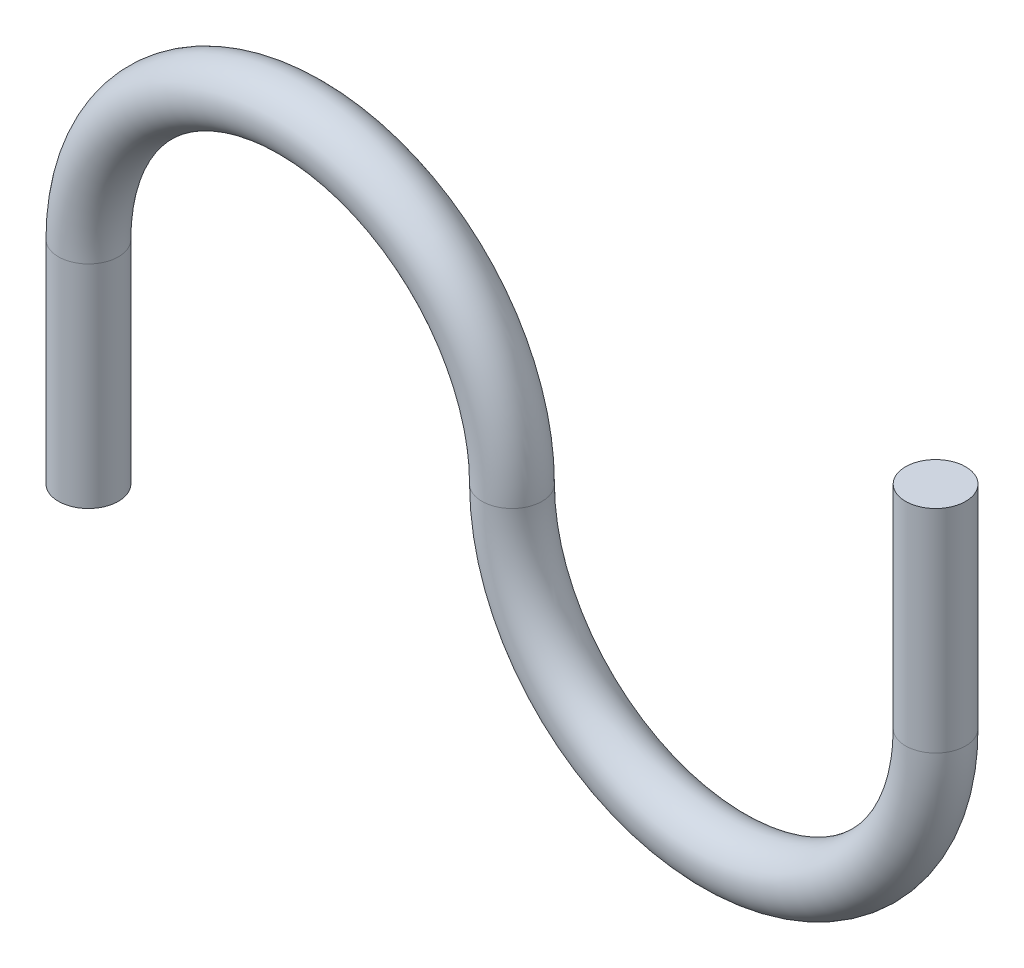
ISO-10303-21;
HEADER;
FILE_DESCRIPTION(('STEP AP214'),'2;1');
FILE_NAME('part.step','',(''),(''),'','','');
FILE_SCHEMA(('AUTOMOTIVE_DESIGN { 1 0 10303 214 1 1 1 1 }'));
ENDSEC;
DATA;
#1=APPLICATION_CONTEXT('core data for automotive mechanical design processes');
#2=APPLICATION_PROTOCOL_DEFINITION('international standard','automotive_design',2000,#1);
#3=PRODUCT_CONTEXT('',#1,'mechanical');
#4=PRODUCT('Part','Part','',(#3));
#5=PRODUCT_RELATED_PRODUCT_CATEGORY('part','',(#4));
#6=PRODUCT_DEFINITION_FORMATION('','',#4);
#7=PRODUCT_DEFINITION_CONTEXT('part definition',#1,'design');
#8=PRODUCT_DEFINITION('design','',#6,#7);
#9=PRODUCT_DEFINITION_SHAPE('','',#8);
#10=(LENGTH_UNIT() NAMED_UNIT(*) SI_UNIT(.MILLI.,.METRE.));
#11=(NAMED_UNIT(*) PLANE_ANGLE_UNIT() SI_UNIT($,.RADIAN.));
#12=(NAMED_UNIT(*) SI_UNIT($,.STERADIAN.) SOLID_ANGLE_UNIT());
#13=UNCERTAINTY_MEASURE_WITH_UNIT(LENGTH_MEASURE(1.E-05),#10,'distance_accuracy_value','');
#14=(GEOMETRIC_REPRESENTATION_CONTEXT(3) GLOBAL_UNCERTAINTY_ASSIGNED_CONTEXT((#13)) GLOBAL_UNIT_ASSIGNED_CONTEXT((#10,
#11,#12)) REPRESENTATION_CONTEXT('',''));
#15=CARTESIAN_POINT('',(0.,0.,0.));
#16=DIRECTION('',(0.,0.,1.));
#17=DIRECTION('',(1.,0.,0.));
#18=AXIS2_PLACEMENT_3D('',#15,#16,#17);
#19=CARTESIAN_POINT('',(-22.4,-22.4,0.));
#20=DIRECTION('',(0.,-1.,0.));
#21=DIRECTION('',(0.,0.,-1.));
#22=AXIS2_PLACEMENT_3D('',#19,#20,#21);
#23=PLANE('',#22);
#24=CARTESIAN_POINT('',(-22.4,-22.4,0.));
#25=DIRECTION('',(0.,-1.,0.));
#26=DIRECTION('',(0.,0.,-1.));
#27=AXIS2_PLACEMENT_3D('',#24,#25,#26);
#28=CIRCLE('',#27,3.175);
#29=CARTESIAN_POINT('',(-22.4,-22.4,-3.175));
#30=VERTEX_POINT('',#29);
#31=EDGE_CURVE('E66',#30,#30,#28,.T.);
#32=ORIENTED_EDGE('',*,*,#31,.T.);
#33=EDGE_LOOP('',(#32));
#34=FACE_BOUND('',#33,.T.);
#35=ADVANCED_FACE('F47',(#34),#23,.T.);
#36=CARTESIAN_POINT('',(67.2,22.4,0.));
#37=DIRECTION('',(0.,-1.,0.));
#38=DIRECTION('',(0.,0.,-1.));
#39=AXIS2_PLACEMENT_3D('',#36,#37,#38);
#40=PLANE('',#39);
#41=CARTESIAN_POINT('',(67.2,22.4,0.));
#42=DIRECTION('',(0.,-1.,0.));
#43=DIRECTION('',(0.,0.,-1.));
#44=AXIS2_PLACEMENT_3D('',#41,#42,#43);
#45=CIRCLE('',#44,3.175);
#46=CARTESIAN_POINT('',(67.2,22.4,-3.175));
#47=VERTEX_POINT('',#46);
#48=EDGE_CURVE('E11',#47,#47,#45,.T.);
#49=ORIENTED_EDGE('',*,*,#48,.F.);
#50=EDGE_LOOP('',(#49));
#51=FACE_BOUND('',#50,.T.);
#52=ADVANCED_FACE('F74',(#51),#40,.F.);
#53=CARTESIAN_POINT('',(-22.4,-22.4,0.));
#54=DIRECTION('',(0.,1.,0.));
#55=DIRECTION('',(0.,0.,1.));
#56=AXIS2_PLACEMENT_3D('',#53,#54,#55);
#57=CYLINDRICAL_SURFACE('',#56,3.175);
#58=CARTESIAN_POINT('',(-22.4,0.,0.));
#59=DIRECTION('',(0.,-1.,0.));
#60=DIRECTION('',(0.,0.,-1.));
#61=AXIS2_PLACEMENT_3D('',#58,#59,#60);
#62=CIRCLE('',#61,3.175);
#63=CARTESIAN_POINT('',(-25.575,0.,0.));
#64=VERTEX_POINT('',#63);
#65=EDGE_CURVE('E61',#64,#64,#62,.T.);
#66=ORIENTED_EDGE('',*,*,#65,.T.);
#67=EDGE_LOOP('',(#66));
#68=FACE_BOUND('',#67,.T.);
#69=ORIENTED_EDGE('',*,*,#31,.F.);
#70=EDGE_LOOP('',(#69));
#71=FACE_BOUND('',#70,.T.);
#72=ADVANCED_FACE('F71',(#68,#71),#57,.T.);
#73=CARTESIAN_POINT('',(0.,0.,0.));
#74=DIRECTION('',(0.,0.,-1.));
#75=DIRECTION('',(-1.,0.,0.));
#76=AXIS2_PLACEMENT_3D('',#73,#74,#75);
#77=TOROIDAL_SURFACE('',#76,22.4,3.175);
#78=CARTESIAN_POINT('',(22.4,0.,0.));
#79=DIRECTION('',(0.,1.,0.));
#80=DIRECTION('',(0.,0.,-1.));
#81=AXIS2_PLACEMENT_3D('',#78,#79,#80);
#82=CIRCLE('',#81,3.175);
#83=CARTESIAN_POINT('',(25.575,0.,0.));
#84=VERTEX_POINT('',#83);
#85=EDGE_CURVE('E57',#84,#84,#82,.T.);
#86=CARTESIAN_POINT('',(0.,0.,0.));
#87=DIRECTION('',(0.,0.,-1.));
#88=DIRECTION('',(-1.,0.,0.));
#89=AXIS2_PLACEMENT_3D('',#86,#87,#88);
#90=CIRCLE('',#89,25.575);
#91=EDGE_CURVE('',#64,#84,#90,.T.);
#92=ORIENTED_EDGE('',*,*,#65,.F.);
#93=ORIENTED_EDGE('',*,*,#85,.T.);
#94=ORIENTED_EDGE('',*,*,#91,.T.);
#95=ORIENTED_EDGE('',*,*,#91,.F.);
#96=EDGE_LOOP('',(#92,#94,#93,#95));
#97=FACE_BOUND('',#96,.T.);
#98=ADVANCED_FACE('F73',(#97),#77,.T.);
#99=CARTESIAN_POINT('',(44.8,0.,0.));
#100=DIRECTION('',(0.,0.,1.));
#101=DIRECTION('',(1.,0.,0.));
#102=AXIS2_PLACEMENT_3D('',#99,#100,#101);
#103=TOROIDAL_SURFACE('',#102,22.4,3.175);
#104=CARTESIAN_POINT('',(67.2,0.,0.));
#105=DIRECTION('',(0.,-1.,0.));
#106=DIRECTION('',(0.,0.,-1.));
#107=AXIS2_PLACEMENT_3D('',#104,#105,#106);
#108=CIRCLE('',#107,3.175);
#109=CARTESIAN_POINT('',(67.2,0.,-3.175));
#110=VERTEX_POINT('',#109);
#111=EDGE_CURVE('E53',#110,#110,#108,.T.);
#112=ORIENTED_EDGE('',*,*,#111,.T.);
#113=EDGE_LOOP('',(#112));
#114=FACE_BOUND('',#113,.T.);
#115=ORIENTED_EDGE('',*,*,#85,.F.);
#116=EDGE_LOOP('',(#115));
#117=FACE_BOUND('',#116,.T.);
#118=ADVANCED_FACE('F81',(#114,#117),#103,.T.);
#119=CARTESIAN_POINT('',(67.2,0.,0.));
#120=DIRECTION('',(0.,1.,0.));
#121=DIRECTION('',(0.,0.,1.));
#122=AXIS2_PLACEMENT_3D('',#119,#120,#121);
#123=CYLINDRICAL_SURFACE('',#122,3.175);
#124=ORIENTED_EDGE('',*,*,#48,.T.);
#125=EDGE_LOOP('',(#124));
#126=FACE_BOUND('',#125,.T.);
#127=ORIENTED_EDGE('',*,*,#111,.F.);
#128=EDGE_LOOP('',(#127));
#129=FACE_BOUND('',#128,.T.);
#130=ADVANCED_FACE('F85',(#126,#129),#123,.T.);
#131=CLOSED_SHELL('',(#35,#52,#72,#98,#118,#130));
#132=MANIFOLD_SOLID_BREP('B2',#131);
#133=ADVANCED_BREP_SHAPE_REPRESENTATION('',(#18,#132),#14);
#134=SHAPE_DEFINITION_REPRESENTATION(#9,#133);
ENDSEC;
END-ISO-10303-21;
